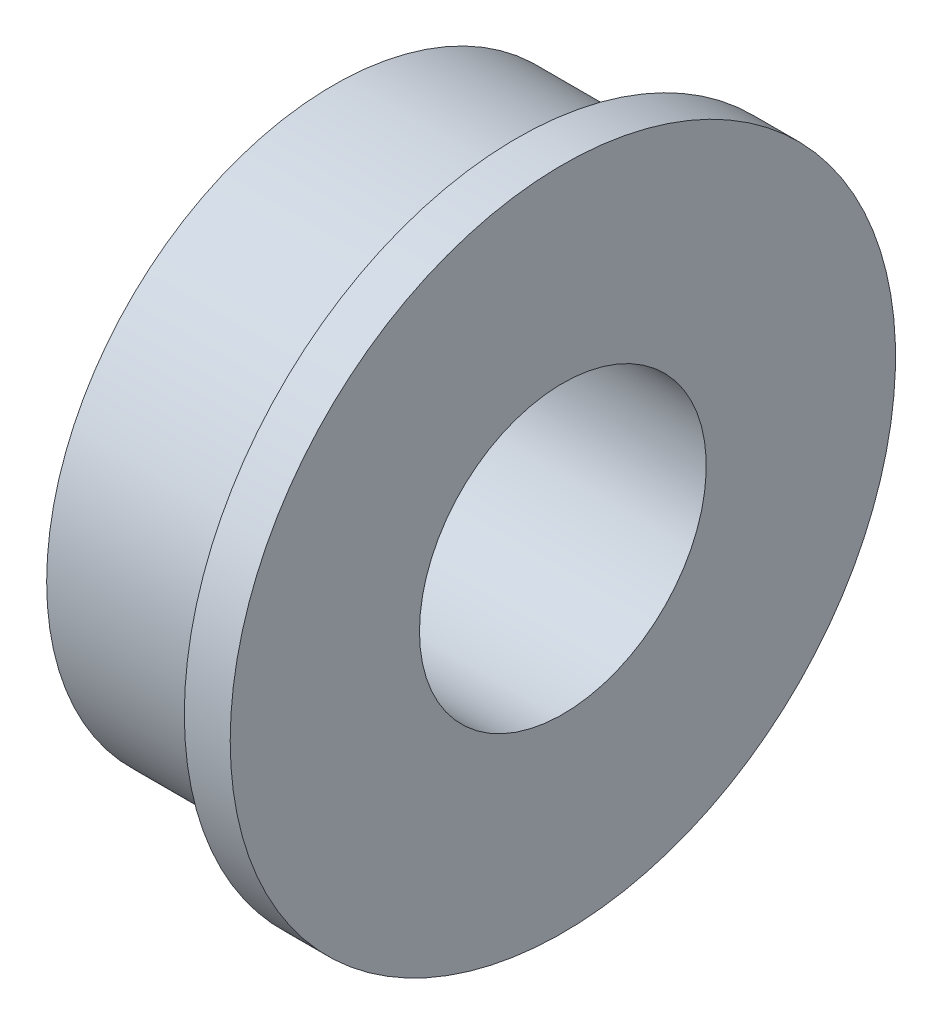
ISO-10303-21;
HEADER;
FILE_DESCRIPTION(('STEP AP214'),'2;1');
FILE_NAME('part.step','',(''),(''),'','','');
FILE_SCHEMA(('AUTOMOTIVE_DESIGN { 1 0 10303 214 1 1 1 1 }'));
ENDSEC;
DATA;
#1=APPLICATION_CONTEXT('core data for automotive mechanical design processes');
#2=APPLICATION_PROTOCOL_DEFINITION('international standard','automotive_design',2000,#1);
#3=PRODUCT_CONTEXT('',#1,'mechanical');
#4=PRODUCT('Part','Part','',(#3));
#5=PRODUCT_RELATED_PRODUCT_CATEGORY('part','',(#4));
#6=PRODUCT_DEFINITION_FORMATION('','',#4);
#7=PRODUCT_DEFINITION_CONTEXT('part definition',#1,'design');
#8=PRODUCT_DEFINITION('design','',#6,#7);
#9=PRODUCT_DEFINITION_SHAPE('','',#8);
#10=(LENGTH_UNIT() NAMED_UNIT(*) SI_UNIT(.MILLI.,.METRE.));
#11=(NAMED_UNIT(*) PLANE_ANGLE_UNIT() SI_UNIT($,.RADIAN.));
#12=(NAMED_UNIT(*) SI_UNIT($,.STERADIAN.) SOLID_ANGLE_UNIT());
#13=UNCERTAINTY_MEASURE_WITH_UNIT(LENGTH_MEASURE(1.E-05),#10,'distance_accuracy_value','');
#14=(GEOMETRIC_REPRESENTATION_CONTEXT(3) GLOBAL_UNCERTAINTY_ASSIGNED_CONTEXT((#13)) GLOBAL_UNIT_ASSIGNED_CONTEXT((#10,
#11,#12)) REPRESENTATION_CONTEXT('',''));
#15=CARTESIAN_POINT('',(0.,0.,0.));
#16=DIRECTION('',(0.,0.,1.));
#17=DIRECTION('',(1.,0.,0.));
#18=AXIS2_PLACEMENT_3D('',#15,#16,#17);
#19=CARTESIAN_POINT('',(2.,2.5,0.));
#20=DIRECTION('',(-1.,0.,0.));
#21=DIRECTION('',(0.,0.,1.));
#22=AXIS2_PLACEMENT_3D('',#19,#20,#21);
#23=PLANE('',#22);
#24=CARTESIAN_POINT('',(2.,0.,0.));
#25=DIRECTION('',(-1.,0.,0.));
#26=DIRECTION('',(0.,0.,1.));
#27=AXIS2_PLACEMENT_3D('',#24,#25,#26);
#28=CIRCLE('',#27,5.8);
#29=CARTESIAN_POINT('',(2.,0.,5.8));
#30=VERTEX_POINT('',#29);
#31=EDGE_CURVE('E10',#30,#30,#28,.T.);
#32=ORIENTED_EDGE('',*,*,#31,.F.);
#33=EDGE_LOOP('',(#32));
#34=FACE_BOUND('',#33,.T.);
#35=CARTESIAN_POINT('',(2.,0.,0.));
#36=DIRECTION('',(-1.,0.,0.));
#37=DIRECTION('',(0.,0.,1.));
#38=AXIS2_PLACEMENT_3D('',#35,#36,#37);
#39=CIRCLE('',#38,2.5);
#40=CARTESIAN_POINT('',(2.,0.,2.5));
#41=VERTEX_POINT('',#40);
#42=EDGE_CURVE('E59',#41,#41,#39,.T.);
#43=ORIENTED_EDGE('',*,*,#42,.T.);
#44=EDGE_LOOP('',(#43));
#45=FACE_BOUND('',#44,.T.);
#46=ADVANCED_FACE('F37',(#34,#45),#23,.F.);
#47=CARTESIAN_POINT('',(-7.87220197432619,0.,0.));
#48=DIRECTION('',(-1.,0.,0.));
#49=DIRECTION('',(0.,0.,1.));
#50=AXIS2_PLACEMENT_3D('',#47,#48,#49);
#51=CYLINDRICAL_SURFACE('',#50,5.8);
#52=CARTESIAN_POINT('',(1.2,0.,0.));
#53=DIRECTION('',(-1.,0.,0.));
#54=DIRECTION('',(0.,0.,1.));
#55=AXIS2_PLACEMENT_3D('',#52,#53,#54);
#56=CIRCLE('',#55,5.8);
#57=CARTESIAN_POINT('',(1.2,0.,5.8));
#58=VERTEX_POINT('',#57);
#59=EDGE_CURVE('E43',#58,#58,#56,.T.);
#60=ORIENTED_EDGE('',*,*,#59,.F.);
#61=EDGE_LOOP('',(#60));
#62=FACE_BOUND('',#61,.T.);
#63=ORIENTED_EDGE('',*,*,#31,.T.);
#64=EDGE_LOOP('',(#63));
#65=FACE_BOUND('',#64,.T.);
#66=ADVANCED_FACE('F84',(#62,#65),#51,.T.);
#67=CARTESIAN_POINT('',(1.2,5.8,0.));
#68=DIRECTION('',(1.,0.,0.));
#69=DIRECTION('',(0.,0.,-1.));
#70=AXIS2_PLACEMENT_3D('',#67,#68,#69);
#71=PLANE('',#70);
#72=CARTESIAN_POINT('',(1.2,0.,0.));
#73=DIRECTION('',(-1.,0.,0.));
#74=DIRECTION('',(0.,0.,1.));
#75=AXIS2_PLACEMENT_3D('',#72,#73,#74);
#76=CIRCLE('',#75,5.);
#77=CARTESIAN_POINT('',(1.2,0.,5.));
#78=VERTEX_POINT('',#77);
#79=EDGE_CURVE('E47',#78,#78,#76,.T.);
#80=ORIENTED_EDGE('',*,*,#79,.F.);
#81=EDGE_LOOP('',(#80));
#82=FACE_BOUND('',#81,.T.);
#83=ORIENTED_EDGE('',*,*,#59,.T.);
#84=EDGE_LOOP('',(#83));
#85=FACE_BOUND('',#84,.T.);
#86=ADVANCED_FACE('F79',(#82,#85),#71,.F.);
#87=CARTESIAN_POINT('',(-7.87220197432619,0.,0.));
#88=DIRECTION('',(-1.,0.,0.));
#89=DIRECTION('',(0.,0.,1.));
#90=AXIS2_PLACEMENT_3D('',#87,#88,#89);
#91=CYLINDRICAL_SURFACE('',#90,5.);
#92=CARTESIAN_POINT('',(-2.,0.,0.));
#93=DIRECTION('',(-1.,0.,0.));
#94=DIRECTION('',(0.,0.,1.));
#95=AXIS2_PLACEMENT_3D('',#92,#93,#94);
#96=CIRCLE('',#95,5.);
#97=CARTESIAN_POINT('',(-2.,0.,5.));
#98=VERTEX_POINT('',#97);
#99=EDGE_CURVE('E51',#98,#98,#96,.T.);
#100=ORIENTED_EDGE('',*,*,#99,.F.);
#101=EDGE_LOOP('',(#100));
#102=FACE_BOUND('',#101,.T.);
#103=ORIENTED_EDGE('',*,*,#79,.T.);
#104=EDGE_LOOP('',(#103));
#105=FACE_BOUND('',#104,.T.);
#106=ADVANCED_FACE('F73',(#102,#105),#91,.T.);
#107=CARTESIAN_POINT('',(-2.,5.,0.));
#108=DIRECTION('',(1.,0.,0.));
#109=DIRECTION('',(0.,0.,-1.));
#110=AXIS2_PLACEMENT_3D('',#107,#108,#109);
#111=PLANE('',#110);
#112=CARTESIAN_POINT('',(-2.,0.,0.));
#113=DIRECTION('',(-1.,0.,0.));
#114=DIRECTION('',(0.,0.,1.));
#115=AXIS2_PLACEMENT_3D('',#112,#113,#114);
#116=CIRCLE('',#115,2.5);
#117=CARTESIAN_POINT('',(-2.,0.,2.5));
#118=VERTEX_POINT('',#117);
#119=EDGE_CURVE('E56',#118,#118,#116,.T.);
#120=ORIENTED_EDGE('',*,*,#119,.F.);
#121=EDGE_LOOP('',(#120));
#122=FACE_BOUND('',#121,.T.);
#123=ORIENTED_EDGE('',*,*,#99,.T.);
#124=EDGE_LOOP('',(#123));
#125=FACE_BOUND('',#124,.T.);
#126=ADVANCED_FACE('F67',(#122,#125),#111,.F.);
#127=CARTESIAN_POINT('',(-7.87220197432619,0.,0.));
#128=DIRECTION('',(-1.,0.,0.));
#129=DIRECTION('',(0.,0.,1.));
#130=AXIS2_PLACEMENT_3D('',#127,#128,#129);
#131=CYLINDRICAL_SURFACE('',#130,2.5);
#132=ORIENTED_EDGE('',*,*,#42,.F.);
#133=EDGE_LOOP('',(#132));
#134=FACE_BOUND('',#133,.T.);
#135=ORIENTED_EDGE('',*,*,#119,.T.);
#136=EDGE_LOOP('',(#135));
#137=FACE_BOUND('',#136,.T.);
#138=ADVANCED_FACE('F64',(#134,#137),#131,.F.);
#139=CLOSED_SHELL('',(#46,#66,#86,#106,#126,#138));
#140=MANIFOLD_SOLID_BREP('B2',#139);
#141=ADVANCED_BREP_SHAPE_REPRESENTATION('',(#18,#140),#14);
#142=SHAPE_DEFINITION_REPRESENTATION(#9,#141);
ENDSEC;
END-ISO-10303-21;
